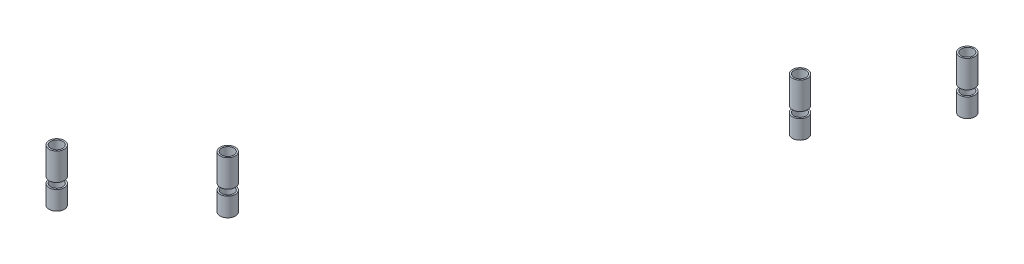
ISO-10303-21;
HEADER;
FILE_DESCRIPTION(('STEP AP214'),'2;1');
FILE_NAME('part.step','',(''),(''),'','','');
FILE_SCHEMA(('AUTOMOTIVE_DESIGN { 1 0 10303 214 1 1 1 1 }'));
ENDSEC;
DATA;
#1=APPLICATION_CONTEXT('core data for automotive mechanical design processes');
#2=APPLICATION_PROTOCOL_DEFINITION('international standard','automotive_design',2000,#1);
#3=PRODUCT_CONTEXT('',#1,'mechanical');
#4=PRODUCT('Part','Part','',(#3));
#5=PRODUCT_RELATED_PRODUCT_CATEGORY('part','',(#4));
#6=PRODUCT_DEFINITION_FORMATION('','',#4);
#7=PRODUCT_DEFINITION_CONTEXT('part definition',#1,'design');
#8=PRODUCT_DEFINITION('design','',#6,#7);
#9=PRODUCT_DEFINITION_SHAPE('','',#8);
#10=(LENGTH_UNIT() NAMED_UNIT(*) SI_UNIT(.MILLI.,.METRE.));
#11=(NAMED_UNIT(*) PLANE_ANGLE_UNIT() SI_UNIT($,.RADIAN.));
#12=(NAMED_UNIT(*) SI_UNIT($,.STERADIAN.) SOLID_ANGLE_UNIT());
#13=UNCERTAINTY_MEASURE_WITH_UNIT(LENGTH_MEASURE(1.E-05),#10,'distance_accuracy_value','');
#14=(GEOMETRIC_REPRESENTATION_CONTEXT(3) GLOBAL_UNCERTAINTY_ASSIGNED_CONTEXT((#13)) GLOBAL_UNIT_ASSIGNED_CONTEXT((#10,
#11,#12)) REPRESENTATION_CONTEXT('',''));
#15=CARTESIAN_POINT('',(0.,0.,0.));
#16=DIRECTION('',(0.,0.,1.));
#17=DIRECTION('',(1.,0.,0.));
#18=AXIS2_PLACEMENT_3D('',#15,#16,#17);
#19=CARTESIAN_POINT('',(-85.5135337309305,461.5,-411.920534849113));
#20=DIRECTION('',(0.,-1.,0.));
#21=DIRECTION('',(0.,0.,1.));
#22=AXIS2_PLACEMENT_3D('',#19,#20,#21);
#23=PLANE('',#22);
#24=CARTESIAN_POINT('',(-85.5135337309305,461.5,-411.920534849113));
#25=DIRECTION('',(0.,1.,0.));
#26=DIRECTION('',(0.,0.,1.));
#27=AXIS2_PLACEMENT_3D('',#24,#25,#26);
#28=CIRCLE('',#27,2.50000000000001);
#29=CARTESIAN_POINT('',(-85.5135337309305,461.5,-409.420534849113));
#30=VERTEX_POINT('',#29);
#31=EDGE_CURVE('E51',#30,#30,#28,.T.);
#32=ORIENTED_EDGE('',*,*,#31,.T.);
#33=EDGE_LOOP('',(#32));
#34=FACE_BOUND('',#33,.T.);
#35=CARTESIAN_POINT('',(-85.5135337309305,461.5,-411.920534849113));
#36=DIRECTION('',(0.,1.,0.));
#37=DIRECTION('',(0.,0.,1.));
#38=AXIS2_PLACEMENT_3D('',#35,#36,#37);
#39=CIRCLE('',#38,1.99999999999998);
#40=CARTESIAN_POINT('',(-85.5135337309305,461.5,-409.920534849113));
#41=VERTEX_POINT('',#40);
#42=EDGE_CURVE('E60',#41,#41,#39,.T.);
#43=ORIENTED_EDGE('',*,*,#42,.F.);
#44=EDGE_LOOP('',(#43));
#45=FACE_BOUND('',#44,.T.);
#46=ADVANCED_FACE('F44',(#34,#45),#23,.F.);
#47=CARTESIAN_POINT('',(-85.5135337309305,448.228932188135,-411.920534849113));
#48=DIRECTION('',(0.,1.,0.));
#49=DIRECTION('',(0.,0.,-1.));
#50=AXIS2_PLACEMENT_3D('',#47,#48,#49);
#51=CYLINDRICAL_SURFACE('',#50,2.50000000000001);
#52=CARTESIAN_POINT('',(-85.5135337309305,455.3,-411.920534849113));
#53=DIRECTION('',(0.,-1.,0.));
#54=DIRECTION('',(0.,0.,-1.));
#55=AXIS2_PLACEMENT_3D('',#52,#53,#54);
#56=CIRCLE('',#55,2.50000000000001);
#57=CARTESIAN_POINT('',(-85.5135337309305,455.3,-414.420534849113));
#58=VERTEX_POINT('',#57);
#59=EDGE_CURVE('E55',#58,#58,#56,.T.);
#60=ORIENTED_EDGE('',*,*,#59,.F.);
#61=EDGE_LOOP('',(#60));
#62=FACE_BOUND('',#61,.T.);
#63=ORIENTED_EDGE('',*,*,#31,.F.);
#64=EDGE_LOOP('',(#63));
#65=FACE_BOUND('',#64,.T.);
#66=ADVANCED_FACE('F68',(#62,#65),#51,.T.);
#67=CARTESIAN_POINT('',(-85.5135337309305,448.228932188135,-411.920534849113));
#68=DIRECTION('',(0.,1.,0.));
#69=DIRECTION('',(0.,0.,-1.));
#70=AXIS2_PLACEMENT_3D('',#67,#68,#69);
#71=CYLINDRICAL_SURFACE('',#70,1.99999999999998);
#72=CARTESIAN_POINT('',(-85.5135337309305,455.3,-411.920534849113));
#73=DIRECTION('',(0.,-1.,0.));
#74=DIRECTION('',(0.,0.,-1.));
#75=AXIS2_PLACEMENT_3D('',#72,#73,#74);
#76=CIRCLE('',#75,1.99999999999998);
#77=CARTESIAN_POINT('',(-85.5135337309305,455.3,-413.920534849113));
#78=VERTEX_POINT('',#77);
#79=EDGE_CURVE('E11',#78,#78,#76,.T.);
#80=ORIENTED_EDGE('',*,*,#79,.T.);
#81=EDGE_LOOP('',(#80));
#82=FACE_BOUND('',#81,.T.);
#83=ORIENTED_EDGE('',*,*,#42,.T.);
#84=EDGE_LOOP('',(#83));
#85=FACE_BOUND('',#84,.T.);
#86=ADVANCED_FACE('F65',(#82,#85),#71,.F.);
#87=CARTESIAN_POINT('',(-199.166238959109,455.3,-261.544556892225));
#88=DIRECTION('',(0.,1.,0.));
#89=DIRECTION('',(0.,0.,-1.));
#90=AXIS2_PLACEMENT_3D('',#87,#88,#89);
#91=PLANE('',#90);
#92=ORIENTED_EDGE('',*,*,#79,.F.);
#93=EDGE_LOOP('',(#92));
#94=FACE_BOUND('',#93,.T.);
#95=ORIENTED_EDGE('',*,*,#59,.T.);
#96=EDGE_LOOP('',(#95));
#97=FACE_BOUND('',#96,.T.);
#98=ADVANCED_FACE('F46',(#94,#97),#91,.F.);
#99=CLOSED_SHELL('',(#46,#66,#86,#98));
#100=MANIFOLD_SOLID_BREP('B2',#99);
#101=CARTESIAN_POINT('',(-106.941386537863,461.5,-378.144106321449));
#102=DIRECTION('',(0.,-1.,0.));
#103=DIRECTION('',(0.,0.,1.));
#104=AXIS2_PLACEMENT_3D('',#101,#102,#103);
#105=PLANE('',#104);
#106=CARTESIAN_POINT('',(-106.941386537863,461.5,-378.144106321449));
#107=DIRECTION('',(0.,1.,0.));
#108=DIRECTION('',(0.,0.,1.));
#109=AXIS2_PLACEMENT_3D('',#106,#107,#108);
#110=CIRCLE('',#109,2.50000000000002);
#111=CARTESIAN_POINT('',(-106.941386537863,461.5,-375.644106321449));
#112=VERTEX_POINT('',#111);
#113=EDGE_CURVE('E121',#112,#112,#110,.T.);
#114=ORIENTED_EDGE('',*,*,#113,.T.);
#115=EDGE_LOOP('',(#114));
#116=FACE_BOUND('',#115,.T.);
#117=CARTESIAN_POINT('',(-106.941386537863,461.5,-378.144106321449));
#118=DIRECTION('',(0.,1.,0.));
#119=DIRECTION('',(0.,0.,1.));
#120=AXIS2_PLACEMENT_3D('',#117,#118,#119);
#121=CIRCLE('',#120,2.00000000000001);
#122=CARTESIAN_POINT('',(-106.941386537863,461.5,-376.144106321449));
#123=VERTEX_POINT('',#122);
#124=EDGE_CURVE('E130',#123,#123,#121,.T.);
#125=ORIENTED_EDGE('',*,*,#124,.F.);
#126=EDGE_LOOP('',(#125));
#127=FACE_BOUND('',#126,.T.);
#128=ADVANCED_FACE('F114',(#116,#127),#105,.F.);
#129=CARTESIAN_POINT('',(-106.941386537863,448.228932188135,-378.144106321449));
#130=DIRECTION('',(0.,1.,0.));
#131=DIRECTION('',(0.,0.,-1.));
#132=AXIS2_PLACEMENT_3D('',#129,#130,#131);
#133=CYLINDRICAL_SURFACE('',#132,2.50000000000002);
#134=CARTESIAN_POINT('',(-106.941386537863,455.3,-378.144106321449));
#135=DIRECTION('',(0.,-1.,0.));
#136=DIRECTION('',(0.,0.,-1.));
#137=AXIS2_PLACEMENT_3D('',#134,#135,#136);
#138=CIRCLE('',#137,2.50000000000002);
#139=CARTESIAN_POINT('',(-106.941386537863,455.3,-380.644106321449));
#140=VERTEX_POINT('',#139);
#141=EDGE_CURVE('E125',#140,#140,#138,.T.);
#142=ORIENTED_EDGE('',*,*,#141,.F.);
#143=EDGE_LOOP('',(#142));
#144=FACE_BOUND('',#143,.T.);
#145=ORIENTED_EDGE('',*,*,#113,.F.);
#146=EDGE_LOOP('',(#145));
#147=FACE_BOUND('',#146,.T.);
#148=ADVANCED_FACE('F138',(#144,#147),#133,.T.);
#149=CARTESIAN_POINT('',(-106.941386537863,448.228932188135,-378.144106321449));
#150=DIRECTION('',(0.,1.,0.));
#151=DIRECTION('',(0.,0.,-1.));
#152=AXIS2_PLACEMENT_3D('',#149,#150,#151);
#153=CYLINDRICAL_SURFACE('',#152,2.00000000000001);
#154=CARTESIAN_POINT('',(-106.941386537863,455.3,-378.144106321449));
#155=DIRECTION('',(0.,-1.,0.));
#156=DIRECTION('',(0.,0.,-1.));
#157=AXIS2_PLACEMENT_3D('',#154,#155,#156);
#158=CIRCLE('',#157,2.00000000000001);
#159=CARTESIAN_POINT('',(-106.941386537863,455.3,-380.144106321449));
#160=VERTEX_POINT('',#159);
#161=EDGE_CURVE('E43',#160,#160,#158,.T.);
#162=ORIENTED_EDGE('',*,*,#161,.T.);
#163=EDGE_LOOP('',(#162));
#164=FACE_BOUND('',#163,.T.);
#165=ORIENTED_EDGE('',*,*,#124,.T.);
#166=EDGE_LOOP('',(#165));
#167=FACE_BOUND('',#166,.T.);
#168=ADVANCED_FACE('F135',(#164,#167),#153,.F.);
#169=CARTESIAN_POINT('',(-199.166238959109,455.3,-261.544556892225));
#170=DIRECTION('',(0.,1.,0.));
#171=DIRECTION('',(0.,0.,-1.));
#172=AXIS2_PLACEMENT_3D('',#169,#170,#171);
#173=PLANE('',#172);
#174=ORIENTED_EDGE('',*,*,#161,.F.);
#175=EDGE_LOOP('',(#174));
#176=FACE_BOUND('',#175,.T.);
#177=ORIENTED_EDGE('',*,*,#141,.T.);
#178=EDGE_LOOP('',(#177));
#179=FACE_BOUND('',#178,.T.);
#180=ADVANCED_FACE('F116',(#176,#179),#173,.F.);
#181=CLOSED_SHELL('',(#128,#148,#168,#180));
#182=MANIFOLD_SOLID_BREP('B6',#181);
#183=CARTESIAN_POINT('',(-179.166238959035,461.5,-261.544556892205));
#184=DIRECTION('',(0.,-1.,0.));
#185=DIRECTION('',(0.,0.,1.));
#186=AXIS2_PLACEMENT_3D('',#183,#184,#185);
#187=PLANE('',#186);
#188=CARTESIAN_POINT('',(-179.166238959035,461.5,-261.544556892205));
#189=DIRECTION('',(0.,1.,0.));
#190=DIRECTION('',(0.,0.,1.));
#191=AXIS2_PLACEMENT_3D('',#188,#189,#190);
#192=CIRCLE('',#191,2.50000000000002);
#193=CARTESIAN_POINT('',(-179.166238959035,461.5,-259.044556892205));
#194=VERTEX_POINT('',#193);
#195=EDGE_CURVE('E191',#194,#194,#192,.T.);
#196=ORIENTED_EDGE('',*,*,#195,.T.);
#197=EDGE_LOOP('',(#196));
#198=FACE_BOUND('',#197,.T.);
#199=CARTESIAN_POINT('',(-179.166238959035,461.5,-261.544556892205));
#200=DIRECTION('',(0.,1.,0.));
#201=DIRECTION('',(0.,0.,1.));
#202=AXIS2_PLACEMENT_3D('',#199,#200,#201);
#203=CIRCLE('',#202,1.99999999694512);
#204=CARTESIAN_POINT('',(-179.166238959035,461.5,-259.54455689526));
#205=VERTEX_POINT('',#204);
#206=EDGE_CURVE('E200',#205,#205,#203,.T.);
#207=ORIENTED_EDGE('',*,*,#206,.F.);
#208=EDGE_LOOP('',(#207));
#209=FACE_BOUND('',#208,.T.);
#210=ADVANCED_FACE('F184',(#198,#209),#187,.F.);
#211=CARTESIAN_POINT('',(-179.166238959035,448.228932188135,-261.544556892205));
#212=DIRECTION('',(0.,1.,0.));
#213=DIRECTION('',(0.,0.,-1.));
#214=AXIS2_PLACEMENT_3D('',#211,#212,#213);
#215=CYLINDRICAL_SURFACE('',#214,2.50000000000002);
#216=CARTESIAN_POINT('',(-179.166238959035,455.3,-261.544556892205));
#217=DIRECTION('',(0.,-1.,0.));
#218=DIRECTION('',(0.,0.,-1.));
#219=AXIS2_PLACEMENT_3D('',#216,#217,#218);
#220=CIRCLE('',#219,2.50000000000002);
#221=CARTESIAN_POINT('',(-179.166238959035,455.3,-264.044556892205));
#222=VERTEX_POINT('',#221);
#223=EDGE_CURVE('E195',#222,#222,#220,.T.);
#224=ORIENTED_EDGE('',*,*,#223,.F.);
#225=EDGE_LOOP('',(#224));
#226=FACE_BOUND('',#225,.T.);
#227=ORIENTED_EDGE('',*,*,#195,.F.);
#228=EDGE_LOOP('',(#227));
#229=FACE_BOUND('',#228,.T.);
#230=ADVANCED_FACE('F208',(#226,#229),#215,.T.);
#231=CARTESIAN_POINT('',(-179.166238959035,448.228932188135,-261.544556892205));
#232=DIRECTION('',(0.,1.,0.));
#233=DIRECTION('',(0.,0.,-1.));
#234=AXIS2_PLACEMENT_3D('',#231,#232,#233);
#235=CYLINDRICAL_SURFACE('',#234,1.99999999694512);
#236=CARTESIAN_POINT('',(-179.166238959035,455.3,-261.544556892205));
#237=DIRECTION('',(0.,-1.,0.));
#238=DIRECTION('',(0.,0.,-1.));
#239=AXIS2_PLACEMENT_3D('',#236,#237,#238);
#240=CIRCLE('',#239,1.99999999694512);
#241=CARTESIAN_POINT('',(-179.166238959035,455.3,-263.54455688915));
#242=VERTEX_POINT('',#241);
#243=EDGE_CURVE('E113',#242,#242,#240,.T.);
#244=ORIENTED_EDGE('',*,*,#243,.T.);
#245=EDGE_LOOP('',(#244));
#246=FACE_BOUND('',#245,.T.);
#247=ORIENTED_EDGE('',*,*,#206,.T.);
#248=EDGE_LOOP('',(#247));
#249=FACE_BOUND('',#248,.T.);
#250=ADVANCED_FACE('F205',(#246,#249),#235,.F.);
#251=CARTESIAN_POINT('',(-199.166238959109,455.3,-261.544556892225));
#252=DIRECTION('',(0.,1.,0.));
#253=DIRECTION('',(0.,0.,-1.));
#254=AXIS2_PLACEMENT_3D('',#251,#252,#253);
#255=PLANE('',#254);
#256=ORIENTED_EDGE('',*,*,#243,.F.);
#257=EDGE_LOOP('',(#256));
#258=FACE_BOUND('',#257,.T.);
#259=ORIENTED_EDGE('',*,*,#223,.T.);
#260=EDGE_LOOP('',(#259));
#261=FACE_BOUND('',#260,.T.);
#262=ADVANCED_FACE('F186',(#258,#261),#255,.F.);
#263=CLOSED_SHELL('',(#210,#230,#250,#262));
#264=MANIFOLD_SOLID_BREP('B38',#263);
#265=CARTESIAN_POINT('',(-209.294177746774,461.5,-235.232823684332));
#266=DIRECTION('',(0.,-1.,0.));
#267=DIRECTION('',(0.,0.,1.));
#268=AXIS2_PLACEMENT_3D('',#265,#266,#267);
#269=PLANE('',#268);
#270=CARTESIAN_POINT('',(-209.294177746774,461.5,-235.232823684332));
#271=DIRECTION('',(0.,1.,0.));
#272=DIRECTION('',(0.,0.,1.));
#273=AXIS2_PLACEMENT_3D('',#270,#271,#272);
#274=CIRCLE('',#273,2.5);
#275=CARTESIAN_POINT('',(-209.294177746774,461.5,-232.732823684332));
#276=VERTEX_POINT('',#275);
#277=EDGE_CURVE('E261',#276,#276,#274,.T.);
#278=ORIENTED_EDGE('',*,*,#277,.T.);
#279=EDGE_LOOP('',(#278));
#280=FACE_BOUND('',#279,.T.);
#281=CARTESIAN_POINT('',(-209.294177746774,461.5,-235.232823684332));
#282=DIRECTION('',(0.,1.,0.));
#283=DIRECTION('',(0.,0.,1.));
#284=AXIS2_PLACEMENT_3D('',#281,#282,#283);
#285=CIRCLE('',#284,2.00000000306296);
#286=CARTESIAN_POINT('',(-209.294177746774,461.5,-233.232823681269));
#287=VERTEX_POINT('',#286);
#288=EDGE_CURVE('E270',#287,#287,#285,.T.);
#289=ORIENTED_EDGE('',*,*,#288,.F.);
#290=EDGE_LOOP('',(#289));
#291=FACE_BOUND('',#290,.T.);
#292=ADVANCED_FACE('F254',(#280,#291),#269,.F.);
#293=CARTESIAN_POINT('',(-209.294177746774,448.228932188135,-235.232823684332));
#294=DIRECTION('',(0.,1.,0.));
#295=DIRECTION('',(0.,0.,-1.));
#296=AXIS2_PLACEMENT_3D('',#293,#294,#295);
#297=CYLINDRICAL_SURFACE('',#296,2.5);
#298=CARTESIAN_POINT('',(-209.294177746774,455.3,-235.232823684332));
#299=DIRECTION('',(0.,-1.,0.));
#300=DIRECTION('',(0.,0.,-1.));
#301=AXIS2_PLACEMENT_3D('',#298,#299,#300);
#302=CIRCLE('',#301,2.5);
#303=CARTESIAN_POINT('',(-209.294177746774,455.3,-237.732823684332));
#304=VERTEX_POINT('',#303);
#305=EDGE_CURVE('E265',#304,#304,#302,.T.);
#306=ORIENTED_EDGE('',*,*,#305,.F.);
#307=EDGE_LOOP('',(#306));
#308=FACE_BOUND('',#307,.T.);
#309=ORIENTED_EDGE('',*,*,#277,.F.);
#310=EDGE_LOOP('',(#309));
#311=FACE_BOUND('',#310,.T.);
#312=ADVANCED_FACE('F278',(#308,#311),#297,.T.);
#313=CARTESIAN_POINT('',(-209.294177746774,448.228932188135,-235.232823684332));
#314=DIRECTION('',(0.,1.,0.));
#315=DIRECTION('',(0.,0.,-1.));
#316=AXIS2_PLACEMENT_3D('',#313,#314,#315);
#317=CYLINDRICAL_SURFACE('',#316,2.00000000306296);
#318=CARTESIAN_POINT('',(-209.294177746774,455.3,-235.232823684332));
#319=DIRECTION('',(0.,-1.,0.));
#320=DIRECTION('',(0.,0.,-1.));
#321=AXIS2_PLACEMENT_3D('',#318,#319,#320);
#322=CIRCLE('',#321,2.00000000306296);
#323=CARTESIAN_POINT('',(-209.294177746774,455.3,-237.232823687395));
#324=VERTEX_POINT('',#323);
#325=EDGE_CURVE('E183',#324,#324,#322,.T.);
#326=ORIENTED_EDGE('',*,*,#325,.T.);
#327=EDGE_LOOP('',(#326));
#328=FACE_BOUND('',#327,.T.);
#329=ORIENTED_EDGE('',*,*,#288,.T.);
#330=EDGE_LOOP('',(#329));
#331=FACE_BOUND('',#330,.T.);
#332=ADVANCED_FACE('F275',(#328,#331),#317,.F.);
#333=CARTESIAN_POINT('',(-199.166238959109,455.3,-261.544556892225));
#334=DIRECTION('',(0.,1.,0.));
#335=DIRECTION('',(0.,0.,-1.));
#336=AXIS2_PLACEMENT_3D('',#333,#334,#335);
#337=PLANE('',#336);
#338=ORIENTED_EDGE('',*,*,#325,.F.);
#339=EDGE_LOOP('',(#338));
#340=FACE_BOUND('',#339,.T.);
#341=ORIENTED_EDGE('',*,*,#305,.T.);
#342=EDGE_LOOP('',(#341));
#343=FACE_BOUND('',#342,.T.);
#344=ADVANCED_FACE('F256',(#340,#343),#337,.F.);
#345=CLOSED_SHELL('',(#292,#312,#332,#344));
#346=MANIFOLD_SOLID_BREP('B108',#345);
#347=CARTESIAN_POINT('',(-85.5135337309305,472.500000000027,-411.920534849113));
#348=DIRECTION('',(0.,-1.,0.));
#349=DIRECTION('',(0.,0.,1.));
#350=AXIS2_PLACEMENT_3D('',#347,#348,#349);
#351=PLANE('',#350);
#352=CARTESIAN_POINT('',(-85.5135337309305,472.500000000027,-411.920534849113));
#353=DIRECTION('',(0.,1.,0.));
#354=DIRECTION('',(0.,0.,1.));
#355=AXIS2_PLACEMENT_3D('',#352,#353,#354);
#356=CIRCLE('',#355,2.5);
#357=CARTESIAN_POINT('',(-85.5135337309305,472.500000000027,-409.420534849113));
#358=VERTEX_POINT('',#357);
#359=EDGE_CURVE('E331',#358,#358,#356,.T.);
#360=ORIENTED_EDGE('',*,*,#359,.T.);
#361=EDGE_LOOP('',(#360));
#362=FACE_BOUND('',#361,.T.);
#363=CARTESIAN_POINT('',(-85.5135337309305,472.500000000027,-411.920534849113));
#364=DIRECTION('',(0.,1.,0.));
#365=DIRECTION('',(0.,0.,1.));
#366=AXIS2_PLACEMENT_3D('',#363,#364,#365);
#367=CIRCLE('',#366,2.);
#368=CARTESIAN_POINT('',(-85.5135337309305,472.500000000027,-409.920534849113));
#369=VERTEX_POINT('',#368);
#370=EDGE_CURVE('E340',#369,#369,#367,.T.);
#371=ORIENTED_EDGE('',*,*,#370,.F.);
#372=EDGE_LOOP('',(#371));
#373=FACE_BOUND('',#372,.T.);
#374=ADVANCED_FACE('F324',(#362,#373),#351,.F.);
#375=CARTESIAN_POINT('',(-85.5135337309305,456.428932188135,-411.920534849113));
#376=DIRECTION('',(0.,1.,0.));
#377=DIRECTION('',(0.,0.,-1.));
#378=AXIS2_PLACEMENT_3D('',#375,#376,#377);
#379=CYLINDRICAL_SURFACE('',#378,2.5);
#380=CARTESIAN_POINT('',(-85.5135337309305,463.5,-411.920534849113));
#381=DIRECTION('',(0.,-1.,0.));
#382=DIRECTION('',(0.,0.,-1.));
#383=AXIS2_PLACEMENT_3D('',#380,#381,#382);
#384=CIRCLE('',#383,2.5);
#385=CARTESIAN_POINT('',(-85.5135337309305,463.5,-414.420534849113));
#386=VERTEX_POINT('',#385);
#387=EDGE_CURVE('E335',#386,#386,#384,.T.);
#388=ORIENTED_EDGE('',*,*,#387,.F.);
#389=EDGE_LOOP('',(#388));
#390=FACE_BOUND('',#389,.T.);
#391=ORIENTED_EDGE('',*,*,#359,.F.);
#392=EDGE_LOOP('',(#391));
#393=FACE_BOUND('',#392,.T.);
#394=ADVANCED_FACE('F348',(#390,#393),#379,.T.);
#395=CARTESIAN_POINT('',(-85.5135337309305,456.428932188135,-411.920534849113));
#396=DIRECTION('',(0.,1.,0.));
#397=DIRECTION('',(0.,0.,-1.));
#398=AXIS2_PLACEMENT_3D('',#395,#396,#397);
#399=CYLINDRICAL_SURFACE('',#398,2.);
#400=CARTESIAN_POINT('',(-85.5135337309305,463.5,-411.920534849113));
#401=DIRECTION('',(0.,-1.,0.));
#402=DIRECTION('',(0.,0.,-1.));
#403=AXIS2_PLACEMENT_3D('',#400,#401,#402);
#404=CIRCLE('',#403,2.);
#405=CARTESIAN_POINT('',(-85.5135337309305,463.5,-413.920534849113));
#406=VERTEX_POINT('',#405);
#407=EDGE_CURVE('E253',#406,#406,#404,.T.);
#408=ORIENTED_EDGE('',*,*,#407,.T.);
#409=EDGE_LOOP('',(#408));
#410=FACE_BOUND('',#409,.T.);
#411=ORIENTED_EDGE('',*,*,#370,.T.);
#412=EDGE_LOOP('',(#411));
#413=FACE_BOUND('',#412,.T.);
#414=ADVANCED_FACE('F345',(#410,#413),#399,.F.);
#415=CARTESIAN_POINT('',(-268.222443474212,463.5,-328.116942343268));
#416=DIRECTION('',(0.,1.,0.));
#417=DIRECTION('',(0.,0.,-1.));
#418=AXIS2_PLACEMENT_3D('',#415,#416,#417);
#419=PLANE('',#418);
#420=ORIENTED_EDGE('',*,*,#407,.F.);
#421=EDGE_LOOP('',(#420));
#422=FACE_BOUND('',#421,.T.);
#423=ORIENTED_EDGE('',*,*,#387,.T.);
#424=EDGE_LOOP('',(#423));
#425=FACE_BOUND('',#424,.T.);
#426=ADVANCED_FACE('F326',(#422,#425),#419,.F.);
#427=CLOSED_SHELL('',(#374,#394,#414,#426));
#428=MANIFOLD_SOLID_BREP('B178',#427);
#429=CARTESIAN_POINT('',(-106.941386537863,472.500000000027,-378.144106321449));
#430=DIRECTION('',(0.,-1.,0.));
#431=DIRECTION('',(0.,0.,1.));
#432=AXIS2_PLACEMENT_3D('',#429,#430,#431);
#433=PLANE('',#432);
#434=CARTESIAN_POINT('',(-106.941386537863,472.500000000027,-378.144106321449));
#435=DIRECTION('',(0.,1.,0.));
#436=DIRECTION('',(0.,0.,1.));
#437=AXIS2_PLACEMENT_3D('',#434,#435,#436);
#438=CIRCLE('',#437,2.5);
#439=CARTESIAN_POINT('',(-106.941386537863,472.500000000027,-375.644106321449));
#440=VERTEX_POINT('',#439);
#441=EDGE_CURVE('E401',#440,#440,#438,.T.);
#442=ORIENTED_EDGE('',*,*,#441,.T.);
#443=EDGE_LOOP('',(#442));
#444=FACE_BOUND('',#443,.T.);
#445=CARTESIAN_POINT('',(-106.941386537863,472.500000000027,-378.144106321449));
#446=DIRECTION('',(0.,1.,0.));
#447=DIRECTION('',(0.,0.,1.));
#448=AXIS2_PLACEMENT_3D('',#445,#446,#447);
#449=CIRCLE('',#448,2.);
#450=CARTESIAN_POINT('',(-106.941386537863,472.500000000027,-376.144106321449));
#451=VERTEX_POINT('',#450);
#452=EDGE_CURVE('E410',#451,#451,#449,.T.);
#453=ORIENTED_EDGE('',*,*,#452,.F.);
#454=EDGE_LOOP('',(#453));
#455=FACE_BOUND('',#454,.T.);
#456=ADVANCED_FACE('F394',(#444,#455),#433,.F.);
#457=CARTESIAN_POINT('',(-106.941386537863,456.428932188135,-378.144106321449));
#458=DIRECTION('',(0.,1.,0.));
#459=DIRECTION('',(0.,0.,-1.));
#460=AXIS2_PLACEMENT_3D('',#457,#458,#459);
#461=CYLINDRICAL_SURFACE('',#460,2.5);
#462=CARTESIAN_POINT('',(-106.941386537863,463.5,-378.144106321449));
#463=DIRECTION('',(0.,-1.,0.));
#464=DIRECTION('',(0.,0.,-1.));
#465=AXIS2_PLACEMENT_3D('',#462,#463,#464);
#466=CIRCLE('',#465,2.5);
#467=CARTESIAN_POINT('',(-106.941386537863,463.5,-380.644106321449));
#468=VERTEX_POINT('',#467);
#469=EDGE_CURVE('E405',#468,#468,#466,.T.);
#470=ORIENTED_EDGE('',*,*,#469,.F.);
#471=EDGE_LOOP('',(#470));
#472=FACE_BOUND('',#471,.T.);
#473=ORIENTED_EDGE('',*,*,#441,.F.);
#474=EDGE_LOOP('',(#473));
#475=FACE_BOUND('',#474,.T.);
#476=ADVANCED_FACE('F418',(#472,#475),#461,.T.);
#477=CARTESIAN_POINT('',(-106.941386537863,456.428932188135,-378.144106321449));
#478=DIRECTION('',(0.,1.,0.));
#479=DIRECTION('',(0.,0.,-1.));
#480=AXIS2_PLACEMENT_3D('',#477,#478,#479);
#481=CYLINDRICAL_SURFACE('',#480,2.);
#482=CARTESIAN_POINT('',(-106.941386537863,463.5,-378.144106321449));
#483=DIRECTION('',(0.,-1.,0.));
#484=DIRECTION('',(0.,0.,-1.));
#485=AXIS2_PLACEMENT_3D('',#482,#483,#484);
#486=CIRCLE('',#485,2.);
#487=CARTESIAN_POINT('',(-106.941386537863,463.5,-380.144106321449));
#488=VERTEX_POINT('',#487);
#489=EDGE_CURVE('E323',#488,#488,#486,.T.);
#490=ORIENTED_EDGE('',*,*,#489,.T.);
#491=EDGE_LOOP('',(#490));
#492=FACE_BOUND('',#491,.T.);
#493=ORIENTED_EDGE('',*,*,#452,.T.);
#494=EDGE_LOOP('',(#493));
#495=FACE_BOUND('',#494,.T.);
#496=ADVANCED_FACE('F415',(#492,#495),#481,.F.);
#497=CARTESIAN_POINT('',(-268.222443474212,463.5,-328.116942343268));
#498=DIRECTION('',(0.,1.,0.));
#499=DIRECTION('',(0.,0.,-1.));
#500=AXIS2_PLACEMENT_3D('',#497,#498,#499);
#501=PLANE('',#500);
#502=ORIENTED_EDGE('',*,*,#489,.F.);
#503=EDGE_LOOP('',(#502));
#504=FACE_BOUND('',#503,.T.);
#505=ORIENTED_EDGE('',*,*,#469,.T.);
#506=EDGE_LOOP('',(#505));
#507=FACE_BOUND('',#506,.T.);
#508=ADVANCED_FACE('F396',(#504,#507),#501,.F.);
#509=CLOSED_SHELL('',(#456,#476,#496,#508));
#510=MANIFOLD_SOLID_BREP('B248',#509);
#511=CARTESIAN_POINT('',(-179.166238959035,472.500000000027,-261.544556892205));
#512=DIRECTION('',(0.,-1.,0.));
#513=DIRECTION('',(0.,0.,1.));
#514=AXIS2_PLACEMENT_3D('',#511,#512,#513);
#515=PLANE('',#514);
#516=CARTESIAN_POINT('',(-179.166238959035,472.500000000027,-261.544556892205));
#517=DIRECTION('',(0.,1.,0.));
#518=DIRECTION('',(0.,0.,1.));
#519=AXIS2_PLACEMENT_3D('',#516,#517,#518);
#520=CIRCLE('',#519,2.5);
#521=CARTESIAN_POINT('',(-179.166238959035,472.500000000027,-259.044556892205));
#522=VERTEX_POINT('',#521);
#523=EDGE_CURVE('E470',#522,#522,#520,.T.);
#524=ORIENTED_EDGE('',*,*,#523,.T.);
#525=EDGE_LOOP('',(#524));
#526=FACE_BOUND('',#525,.T.);
#527=CARTESIAN_POINT('',(-179.166238959035,472.500000000027,-261.544556892205));
#528=DIRECTION('',(0.,1.,0.));
#529=DIRECTION('',(0.,0.,1.));
#530=AXIS2_PLACEMENT_3D('',#527,#528,#529);
#531=CIRCLE('',#530,2.00000000000012);
#532=CARTESIAN_POINT('',(-179.166238959035,472.500000000027,-259.544556892205));
#533=VERTEX_POINT('',#532);
#534=EDGE_CURVE('E479',#533,#533,#531,.T.);
#535=ORIENTED_EDGE('',*,*,#534,.F.);
#536=EDGE_LOOP('',(#535));
#537=FACE_BOUND('',#536,.T.);
#538=ADVANCED_FACE('F463',(#526,#537),#515,.F.);
#539=CARTESIAN_POINT('',(-179.166238959035,456.428932188135,-261.544556892205));
#540=DIRECTION('',(0.,1.,0.));
#541=DIRECTION('',(0.,0.,-1.));
#542=AXIS2_PLACEMENT_3D('',#539,#540,#541);
#543=CYLINDRICAL_SURFACE('',#542,2.5);
#544=CARTESIAN_POINT('',(-179.166238959035,463.5,-261.544556892205));
#545=DIRECTION('',(0.,-1.,0.));
#546=DIRECTION('',(0.,0.,-1.));
#547=AXIS2_PLACEMENT_3D('',#544,#545,#546);
#548=CIRCLE('',#547,2.5);
#549=CARTESIAN_POINT('',(-179.166238959035,463.5,-264.044556892205));
#550=VERTEX_POINT('',#549);
#551=EDGE_CURVE('E474',#550,#550,#548,.T.);
#552=ORIENTED_EDGE('',*,*,#551,.F.);
#553=EDGE_LOOP('',(#552));
#554=FACE_BOUND('',#553,.T.);
#555=ORIENTED_EDGE('',*,*,#523,.F.);
#556=EDGE_LOOP('',(#555));
#557=FACE_BOUND('',#556,.T.);
#558=ADVANCED_FACE('F487',(#554,#557),#543,.T.);
#559=CARTESIAN_POINT('',(-179.166238959035,456.428932188135,-261.544556892205));
#560=DIRECTION('',(0.,1.,0.));
#561=DIRECTION('',(0.,0.,-1.));
#562=AXIS2_PLACEMENT_3D('',#559,#560,#561);
#563=CYLINDRICAL_SURFACE('',#562,2.00000000000012);
#564=CARTESIAN_POINT('',(-179.166238960447,463.5,-261.544556895064));
#565=DIRECTION('',(0.,-1.,0.));
#566=DIRECTION('',(0.,0.,-1.));
#567=AXIS2_PLACEMENT_3D('',#564,#565,#566);
#568=CIRCLE('',#567,2.0000000000001);
#569=CARTESIAN_POINT('',(-179.166238960447,463.5,-263.544556895064));
#570=VERTEX_POINT('',#569);
#571=EDGE_CURVE('E393',#570,#570,#568,.T.);
#572=ORIENTED_EDGE('',*,*,#571,.T.);
#573=EDGE_LOOP('',(#572));
#574=FACE_BOUND('',#573,.T.);
#575=ORIENTED_EDGE('',*,*,#534,.T.);
#576=EDGE_LOOP('',(#575));
#577=FACE_BOUND('',#576,.T.);
#578=ADVANCED_FACE('F484',(#574,#577),#563,.F.);
#579=CARTESIAN_POINT('',(-268.222443474212,463.5,-328.116942343268));
#580=DIRECTION('',(0.,1.,0.));
#581=DIRECTION('',(0.,0.,-1.));
#582=AXIS2_PLACEMENT_3D('',#579,#580,#581);
#583=PLANE('',#582);
#584=ORIENTED_EDGE('',*,*,#571,.F.);
#585=EDGE_LOOP('',(#584));
#586=FACE_BOUND('',#585,.T.);
#587=ORIENTED_EDGE('',*,*,#551,.T.);
#588=EDGE_LOOP('',(#587));
#589=FACE_BOUND('',#588,.T.);
#590=ADVANCED_FACE('F465',(#586,#589),#583,.F.);
#591=CLOSED_SHELL('',(#538,#558,#578,#590));
#592=MANIFOLD_SOLID_BREP('B318',#591);
#593=CARTESIAN_POINT('',(-209.294177746774,472.500000000027,-235.232823684332));
#594=DIRECTION('',(0.,-1.,0.));
#595=DIRECTION('',(0.,0.,1.));
#596=AXIS2_PLACEMENT_3D('',#593,#594,#595);
#597=PLANE('',#596);
#598=CARTESIAN_POINT('',(-209.294177746774,472.500000000027,-235.232823684332));
#599=DIRECTION('',(0.,1.,0.));
#600=DIRECTION('',(0.,0.,1.));
#601=AXIS2_PLACEMENT_3D('',#598,#599,#600);
#602=CIRCLE('',#601,2.5);
#603=CARTESIAN_POINT('',(-209.294177746774,472.500000000027,-232.732823684332));
#604=VERTEX_POINT('',#603);
#605=EDGE_CURVE('E532',#604,#604,#602,.T.);
#606=ORIENTED_EDGE('',*,*,#605,.T.);
#607=EDGE_LOOP('',(#606));
#608=FACE_BOUND('',#607,.T.);
#609=CARTESIAN_POINT('',(-209.294177746774,472.500000000027,-235.232823684332));
#610=DIRECTION('',(0.,1.,0.));
#611=DIRECTION('',(0.,0.,1.));
#612=AXIS2_PLACEMENT_3D('',#609,#610,#611);
#613=CIRCLE('',#612,2.00000000000011);
#614=CARTESIAN_POINT('',(-209.294177746774,472.500000000027,-233.232823684331));
#615=VERTEX_POINT('',#614);
#616=EDGE_CURVE('E541',#615,#615,#613,.T.);
#617=ORIENTED_EDGE('',*,*,#616,.F.);
#618=EDGE_LOOP('',(#617));
#619=FACE_BOUND('',#618,.T.);
#620=ADVANCED_FACE('F525',(#608,#619),#597,.F.);
#621=CARTESIAN_POINT('',(-209.294177746774,456.428932188135,-235.232823684332));
#622=DIRECTION('',(0.,1.,0.));
#623=DIRECTION('',(0.,0.,-1.));
#624=AXIS2_PLACEMENT_3D('',#621,#622,#623);
#625=CYLINDRICAL_SURFACE('',#624,2.5);
#626=CARTESIAN_POINT('',(-209.294177746774,463.5,-235.232823684332));
#627=DIRECTION('',(0.,-1.,0.));
#628=DIRECTION('',(0.,0.,-1.));
#629=AXIS2_PLACEMENT_3D('',#626,#627,#628);
#630=CIRCLE('',#629,2.5);
#631=CARTESIAN_POINT('',(-209.294177746774,463.5,-237.732823684332));
#632=VERTEX_POINT('',#631);
#633=EDGE_CURVE('E536',#632,#632,#630,.T.);
#634=ORIENTED_EDGE('',*,*,#633,.F.);
#635=EDGE_LOOP('',(#634));
#636=FACE_BOUND('',#635,.T.);
#637=ORIENTED_EDGE('',*,*,#605,.F.);
#638=EDGE_LOOP('',(#637));
#639=FACE_BOUND('',#638,.T.);
#640=ADVANCED_FACE('F549',(#636,#639),#625,.T.);
#641=CARTESIAN_POINT('',(-209.294177746774,456.428932188135,-235.232823684332));
#642=DIRECTION('',(0.,1.,0.));
#643=DIRECTION('',(0.,0.,-1.));
#644=AXIS2_PLACEMENT_3D('',#641,#642,#643);
#645=CYLINDRICAL_SURFACE('',#644,2.00000000000011);
#646=CARTESIAN_POINT('',(-209.294177748143,463.5,-235.232823687142));
#647=DIRECTION('',(0.,-1.,0.));
#648=DIRECTION('',(0.,0.,-1.));
#649=AXIS2_PLACEMENT_3D('',#646,#647,#648);
#650=CIRCLE('',#649,2.0000000000001);
#651=CARTESIAN_POINT('',(-209.294177748143,463.5,-237.232823687143));
#652=VERTEX_POINT('',#651);
#653=EDGE_CURVE('E462',#652,#652,#650,.T.);
#654=ORIENTED_EDGE('',*,*,#653,.T.);
#655=EDGE_LOOP('',(#654));
#656=FACE_BOUND('',#655,.T.);
#657=ORIENTED_EDGE('',*,*,#616,.T.);
#658=EDGE_LOOP('',(#657));
#659=FACE_BOUND('',#658,.T.);
#660=ADVANCED_FACE('F546',(#656,#659),#645,.F.);
#661=CARTESIAN_POINT('',(-268.222443474212,463.5,-328.116942343268));
#662=DIRECTION('',(0.,1.,0.));
#663=DIRECTION('',(0.,0.,-1.));
#664=AXIS2_PLACEMENT_3D('',#661,#662,#663);
#665=PLANE('',#664);
#666=ORIENTED_EDGE('',*,*,#653,.F.);
#667=EDGE_LOOP('',(#666));
#668=FACE_BOUND('',#667,.T.);
#669=ORIENTED_EDGE('',*,*,#633,.T.);
#670=EDGE_LOOP('',(#669));
#671=FACE_BOUND('',#670,.T.);
#672=ADVANCED_FACE('F527',(#668,#671),#665,.F.);
#673=CLOSED_SHELL('',(#620,#640,#660,#672));
#674=MANIFOLD_SOLID_BREP('B388',#673);
#675=ADVANCED_BREP_SHAPE_REPRESENTATION('',(#18,#100,#182,#264,#346,#428,#510,#592,#674),#14);
#676=SHAPE_DEFINITION_REPRESENTATION(#9,#675);
ENDSEC;
END-ISO-10303-21;
